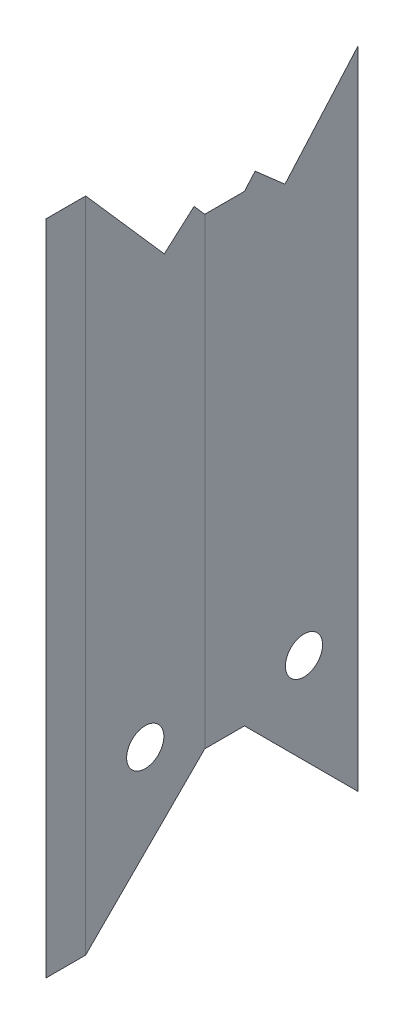
ISO-10303-21;
HEADER;
FILE_DESCRIPTION(('STEP AP214'),'2;1');
FILE_NAME('part.step','',(''),(''),'','','');
FILE_SCHEMA(('AUTOMOTIVE_DESIGN { 1 0 10303 214 1 1 1 1 }'));
ENDSEC;
DATA;
#1=APPLICATION_CONTEXT('core data for automotive mechanical design processes');
#2=APPLICATION_PROTOCOL_DEFINITION('international standard','automotive_design',2000,#1);
#3=PRODUCT_CONTEXT('',#1,'mechanical');
#4=PRODUCT('Part','Part','',(#3));
#5=PRODUCT_RELATED_PRODUCT_CATEGORY('part','',(#4));
#6=PRODUCT_DEFINITION_FORMATION('','',#4);
#7=PRODUCT_DEFINITION_CONTEXT('part definition',#1,'design');
#8=PRODUCT_DEFINITION('design','',#6,#7);
#9=PRODUCT_DEFINITION_SHAPE('','',#8);
#10=(LENGTH_UNIT() NAMED_UNIT(*) SI_UNIT(.MILLI.,.METRE.));
#11=(NAMED_UNIT(*) PLANE_ANGLE_UNIT() SI_UNIT($,.RADIAN.));
#12=(NAMED_UNIT(*) SI_UNIT($,.STERADIAN.) SOLID_ANGLE_UNIT());
#13=UNCERTAINTY_MEASURE_WITH_UNIT(LENGTH_MEASURE(1.E-05),#10,'distance_accuracy_value','');
#14=(GEOMETRIC_REPRESENTATION_CONTEXT(3) GLOBAL_UNCERTAINTY_ASSIGNED_CONTEXT((#13)) GLOBAL_UNIT_ASSIGNED_CONTEXT((#10,
#11,#12)) REPRESENTATION_CONTEXT('',''));
#15=CARTESIAN_POINT('',(0.,0.,0.));
#16=DIRECTION('',(0.,0.,1.));
#17=DIRECTION('',(1.,0.,0.));
#18=AXIS2_PLACEMENT_3D('',#15,#16,#17);
#19=CARTESIAN_POINT('',(210.000000000222,-2.77555756156289E-13,-225.41093404791));
#20=DIRECTION('',(-7.67808940385817E-13,0.,-1.));
#21=DIRECTION('',(-1.,0.,7.67808940385817E-13));
#22=AXIS2_PLACEMENT_3D('',#19,#20,#21);
#23=PLANE('',#22);
#24=DIRECTION('',(1.,0.,0.));
#25=VECTOR('',#24,1.);
#26=CARTESIAN_POINT('',(117.700000000018,334.36429325198,-225.410934047839));
#27=LINE('',#26,#25);
#28=CARTESIAN_POINT('',(117.699000000018,334.36429325198,-225.410934047839));
#29=VERTEX_POINT('',#28);
#30=CARTESIAN_POINT('',(117.699500000018,334.36429325198,-225.410934047839));
#31=VERTEX_POINT('',#30);
#32=EDGE_CURVE('E581',#29,#31,#27,.T.);
#33=ORIENTED_EDGE('',*,*,#32,.T.);
#34=DIRECTION('',(0.,-1.,0.));
#35=VECTOR('',#34,1.);
#36=CARTESIAN_POINT('',(117.699500000018,186.231008312995,-225.410934047839));
#37=LINE('',#36,#35);
#38=CARTESIAN_POINT('',(117.699500000018,38.0980000000001,-225.410934047839));
#39=VERTEX_POINT('',#38);
#40=EDGE_CURVE('E379',#31,#39,#37,.T.);
#41=ORIENTED_EDGE('',*,*,#40,.T.);
#42=DIRECTION('',(1.,0.,-7.67808940385817E-13));
#43=VECTOR('',#42,1.);
#44=CARTESIAN_POINT('',(117.700000000017,38.0980000000001,-225.410934047839));
#45=LINE('',#44,#43);
#46=CARTESIAN_POINT('',(117.699000000018,38.098,-225.410934047839));
#47=VERTEX_POINT('',#46);
#48=EDGE_CURVE('E574',#47,#39,#45,.T.);
#49=ORIENTED_EDGE('',*,*,#48,.F.);
#50=DIRECTION('',(0.,1.,0.));
#51=VECTOR('',#50,1.);
#52=CARTESIAN_POINT('',(117.699000000018,325.368876910929,-225.410934047839));
#53=LINE('',#52,#51);
#54=EDGE_CURVE('E578',#47,#29,#53,.T.);
#55=ORIENTED_EDGE('',*,*,#54,.T.);
#56=EDGE_LOOP('',(#33,#41,#49,#55));
#57=FACE_BOUND('',#56,.T.);
#58=ADVANCED_FACE('F51',(#57),#23,.T.);
#59=CARTESIAN_POINT('',(117.70000000002,382.613735215774,-149.214934047839));
#60=DIRECTION('',(0.,0.,-1.));
#61=DIRECTION('',(0.,-1.,0.));
#62=AXIS2_PLACEMENT_3D('',#59,#60,#61);
#63=PLANE('',#62);
#64=DIRECTION('',(1.,0.,0.));
#65=VECTOR('',#64,1.);
#66=CARTESIAN_POINT('',(117.700000000018,-38.0979999999999,-149.214934047839));
#67=LINE('',#66,#65);
#68=CARTESIAN_POINT('',(117.699000000019,-38.0979999999999,-149.214934047839));
#69=VERTEX_POINT('',#68);
#70=CARTESIAN_POINT('',(117.699500000019,-38.0979999999999,-149.214934047839));
#71=VERTEX_POINT('',#70);
#72=EDGE_CURVE('E566',#69,#71,#67,.T.);
#73=ORIENTED_EDGE('',*,*,#72,.T.);
#74=DIRECTION('',(0.,1.,0.));
#75=VECTOR('',#74,1.);
#76=CARTESIAN_POINT('',(117.69950000002,172.257867607887,-149.214934047839));
#77=LINE('',#76,#75);
#78=CARTESIAN_POINT('',(117.699500000021,382.613735215774,-149.214934047839));
#79=VERTEX_POINT('',#78);
#80=EDGE_CURVE('E417',#71,#79,#77,.T.);
#81=ORIENTED_EDGE('',*,*,#80,.T.);
#82=DIRECTION('',(1.,0.,5.64864391357309E-11));
#83=VECTOR('',#82,1.);
#84=CARTESIAN_POINT('',(117.70000000002,382.613735215774,-149.214934047839));
#85=LINE('',#84,#83);
#86=CARTESIAN_POINT('',(117.69900000002,382.613735215774,-149.214934047839));
#87=VERTEX_POINT('',#86);
#88=EDGE_CURVE('E559',#87,#79,#85,.T.);
#89=ORIENTED_EDGE('',*,*,#88,.F.);
#90=DIRECTION('',(0.,-1.,0.));
#91=VECTOR('',#90,1.);
#92=CARTESIAN_POINT('',(117.69900000002,325.368876910929,-149.214934047839));
#93=LINE('',#92,#91);
#94=EDGE_CURVE('E563',#87,#69,#93,.T.);
#95=ORIENTED_EDGE('',*,*,#94,.T.);
#96=EDGE_LOOP('',(#73,#81,#89,#95));
#97=FACE_BOUND('',#96,.T.);
#98=ADVANCED_FACE('F859',(#97),#63,.F.);
#99=CARTESIAN_POINT('',(117.700000000018,-19.0499999999999,-168.262934047839));
#100=DIRECTION('',(0.,0.707106781186548,0.707106781186547));
#101=DIRECTION('',(0.,-0.707106781186547,0.707106781186548));
#102=AXIS2_PLACEMENT_3D('',#99,#100,#101);
#103=PLANE('',#102);
#104=ORIENTED_EDGE('',*,*,#72,.F.);
#105=DIRECTION('',(0.,-0.707106781186547,0.707106781186548));
#106=VECTOR('',#105,1.);
#107=CARTESIAN_POINT('',(117.699000000018,-19.0499999999999,-168.262934047839));
#108=LINE('',#107,#106);
#109=EDGE_CURVE('E536',#47,#69,#108,.T.);
#110=ORIENTED_EDGE('',*,*,#109,.F.);
#111=ORIENTED_EDGE('',*,*,#48,.T.);
#112=DIRECTION('',(1.,0.,0.));
#113=VECTOR('',#112,1.);
#114=CARTESIAN_POINT('',(117.700000000018,38.0980000000008,-225.41093404784));
#115=LINE('',#114,#113);
#116=CARTESIAN_POINT('',(117.700000000018,38.0980000000008,-225.41093404784));
#117=VERTEX_POINT('',#116);
#118=EDGE_CURVE('E409',#39,#117,#115,.T.);
#119=ORIENTED_EDGE('',*,*,#118,.T.);
#120=DIRECTION('',(0.,-0.707106781186547,0.707106781186548));
#121=VECTOR('',#120,1.);
#122=CARTESIAN_POINT('',(117.700000000018,-19.0499999999999,-168.262934047839));
#123=LINE('',#122,#121);
#124=CARTESIAN_POINT('',(117.700000000018,-38.0979999999998,-149.214934047839));
#125=VERTEX_POINT('',#124);
#126=EDGE_CURVE('E519',#117,#125,#123,.T.);
#127=ORIENTED_EDGE('',*,*,#126,.T.);
#128=DIRECTION('',(1.,0.,0.));
#129=VECTOR('',#128,1.);
#130=CARTESIAN_POINT('',(117.700000000019,-38.0979999999998,-149.214934047839));
#131=LINE('',#130,#129);
#132=EDGE_CURVE('E501',#71,#125,#131,.T.);
#133=ORIENTED_EDGE('',*,*,#132,.F.);
#134=EDGE_LOOP('',(#104,#110,#111,#119,#127,#133));
#135=FACE_BOUND('',#134,.T.);
#136=ADVANCED_FACE('F633',(#135),#103,.F.);
#137=CARTESIAN_POINT('',(117.700000000019,342.132612713132,-218.586519765696));
#138=DIRECTION('',(0.,0.659989598511923,-0.751274736601778));
#139=DIRECTION('',(0.,0.751274736601778,0.659989598511923));
#140=AXIS2_PLACEMENT_3D('',#137,#138,#139);
#141=PLANE('',#140);
#142=ORIENTED_EDGE('',*,*,#32,.F.);
#143=DIRECTION('',(0.,0.751274736601778,0.659989598511923));
#144=VECTOR('',#143,1.);
#145=CARTESIAN_POINT('',(117.699000000018,342.132612713132,-218.586519765696));
#146=LINE('',#145,#144);
#147=CARTESIAN_POINT('',(117.699000000018,342.132612713132,-218.586519765696));
#148=VERTEX_POINT('',#147);
#149=EDGE_CURVE('E540',#29,#148,#146,.T.);
#150=ORIENTED_EDGE('',*,*,#149,.T.);
#151=DIRECTION('',(1.,0.,0.));
#152=VECTOR('',#151,1.);
#153=CARTESIAN_POINT('',(117.700000000019,342.132612713132,-218.586519765696));
#154=LINE('',#153,#152);
#155=CARTESIAN_POINT('',(117.700000000019,342.132612713132,-218.586519765696));
#156=VERTEX_POINT('',#155);
#157=EDGE_CURVE('E552',#148,#156,#154,.T.);
#158=ORIENTED_EDGE('',*,*,#157,.T.);
#159=DIRECTION('',(0.,0.751274736601778,0.659989598511923));
#160=VECTOR('',#159,1.);
#161=CARTESIAN_POINT('',(117.700000000019,342.132612713132,-218.586519765696));
#162=LINE('',#161,#160);
#163=CARTESIAN_POINT('',(117.700000000018,334.36429325198,-225.410934047839));
#164=VERTEX_POINT('',#163);
#165=EDGE_CURVE('E523',#164,#156,#162,.T.);
#166=ORIENTED_EDGE('',*,*,#165,.F.);
#167=DIRECTION('',(1.,0.,0.));
#168=VECTOR('',#167,1.);
#169=CARTESIAN_POINT('',(117.700000000018,334.36429325198,-225.410934047839));
#170=LINE('',#169,#168);
#171=EDGE_CURVE('E393',#31,#164,#170,.T.);
#172=ORIENTED_EDGE('',*,*,#171,.F.);
#173=EDGE_LOOP('',(#142,#150,#158,#166,#172));
#174=FACE_BOUND('',#173,.T.);
#175=ADVANCED_FACE('F644',(#174),#141,.T.);
#176=CARTESIAN_POINT('',(117.700000000019,325.368876910929,-199.504141456011));
#177=DIRECTION('',(0.,-0.751274736601778,-0.659989598511923));
#178=DIRECTION('',(0.,0.659989598511923,-0.751274736601778));
#179=AXIS2_PLACEMENT_3D('',#176,#177,#178);
#180=PLANE('',#179);
#181=ORIENTED_EDGE('',*,*,#157,.F.);
#182=DIRECTION('',(0.,0.659989598511923,-0.751274736601778));
#183=VECTOR('',#182,1.);
#184=CARTESIAN_POINT('',(117.699000000019,325.368876910929,-199.504141456011));
#185=LINE('',#184,#183);
#186=CARTESIAN_POINT('',(117.699000000019,325.368876910929,-199.504141456011));
#187=VERTEX_POINT('',#186);
#188=EDGE_CURVE('E505',#187,#148,#185,.T.);
#189=ORIENTED_EDGE('',*,*,#188,.F.);
#190=DIRECTION('',(1.,0.,0.));
#191=VECTOR('',#190,1.);
#192=CARTESIAN_POINT('',(117.700000000019,325.368876910929,-199.504141456011));
#193=LINE('',#192,#191);
#194=CARTESIAN_POINT('',(117.700000000019,325.368876910929,-199.504141456011));
#195=VERTEX_POINT('',#194);
#196=EDGE_CURVE('E531',#187,#195,#193,.T.);
#197=ORIENTED_EDGE('',*,*,#196,.T.);
#198=DIRECTION('',(0.,0.659989598511923,-0.751274736601778));
#199=VECTOR('',#198,1.);
#200=CARTESIAN_POINT('',(117.700000000019,325.368876910929,-199.504141456011));
#201=LINE('',#200,#199);
#202=EDGE_CURVE('E510',#195,#156,#201,.T.);
#203=ORIENTED_EDGE('',*,*,#202,.T.);
#204=EDGE_LOOP('',(#181,#189,#197,#203));
#205=FACE_BOUND('',#204,.T.);
#206=ADVANCED_FACE('F877',(#205),#180,.F.);
#207=CARTESIAN_POINT('',(117.700000000015,166.6622814955,-338.926774863348));
#208=DIRECTION('',(0.,0.659989598511923,-0.751274736601778));
#209=DIRECTION('',(0.,0.751274736601778,0.659989598511923));
#210=AXIS2_PLACEMENT_3D('',#207,#208,#209);
#211=PLANE('',#210);
#212=ORIENTED_EDGE('',*,*,#196,.F.);
#213=DIRECTION('',(0.,0.751274736601778,0.659989598511923));
#214=VECTOR('',#213,1.);
#215=CARTESIAN_POINT('',(117.699000000015,166.6622814955,-338.926774863348));
#216=LINE('',#215,#214);
#217=EDGE_CURVE('E532',#187,#87,#216,.T.);
#218=ORIENTED_EDGE('',*,*,#217,.T.);
#219=ORIENTED_EDGE('',*,*,#88,.T.);
#220=DIRECTION('',(1.,0.,0.));
#221=VECTOR('',#220,1.);
#222=CARTESIAN_POINT('',(117.70000000002,382.613735215774,-149.214934047839));
#223=LINE('',#222,#221);
#224=CARTESIAN_POINT('',(117.70000000002,382.613735215774,-149.214934047839));
#225=VERTEX_POINT('',#224);
#226=EDGE_CURVE('E496',#79,#225,#223,.T.);
#227=ORIENTED_EDGE('',*,*,#226,.T.);
#228=DIRECTION('',(0.,0.751274736601778,0.659989598511923));
#229=VECTOR('',#228,1.);
#230=CARTESIAN_POINT('',(117.700000000015,166.6622814955,-338.926774863348));
#231=LINE('',#230,#229);
#232=EDGE_CURVE('E514',#195,#225,#231,.T.);
#233=ORIENTED_EDGE('',*,*,#232,.F.);
#234=EDGE_LOOP('',(#212,#218,#219,#227,#233));
#235=FACE_BOUND('',#234,.T.);
#236=ADVANCED_FACE('F871',(#235),#211,.T.);
#237=CARTESIAN_POINT('',(117.700000000018,58.1000000000001,-187.312934047839));
#238=DIRECTION('',(1.,0.,0.));
#239=DIRECTION('',(0.,0.,-1.));
#240=AXIS2_PLACEMENT_3D('',#237,#238,#239);
#241=CYLINDRICAL_SURFACE('',#240,11.90625);
#242=CARTESIAN_POINT('',(117.700000000018,58.1000000000001,-187.312934047839));
#243=DIRECTION('',(-1.,0.,0.));
#244=DIRECTION('',(0.,0.,1.));
#245=AXIS2_PLACEMENT_3D('',#242,#243,#244);
#246=CIRCLE('',#245,11.90625);
#247=CARTESIAN_POINT('',(117.700000000018,58.1000000000001,-175.406684047839));
#248=VERTEX_POINT('',#247);
#249=EDGE_CURVE('E527',#248,#248,#246,.T.);
#250=ORIENTED_EDGE('',*,*,#249,.F.);
#251=EDGE_LOOP('',(#250));
#252=FACE_BOUND('',#251,.T.);
#253=CARTESIAN_POINT('',(117.699000000018,58.1000000000001,-187.312934047839));
#254=DIRECTION('',(-1.,0.,0.));
#255=DIRECTION('',(0.,0.,1.));
#256=AXIS2_PLACEMENT_3D('',#253,#254,#255);
#257=CIRCLE('',#256,11.90625);
#258=CARTESIAN_POINT('',(117.699000000018,58.1000000000001,-175.406684047839));
#259=VERTEX_POINT('',#258);
#260=EDGE_CURVE('E515',#259,#259,#257,.T.);
#261=ORIENTED_EDGE('',*,*,#260,.T.);
#262=EDGE_LOOP('',(#261));
#263=FACE_BOUND('',#262,.T.);
#264=ADVANCED_FACE('F867',(#252,#263),#241,.F.);
#265=CARTESIAN_POINT('',(117.700000000019,325.368876910929,-199.504141456011));
#266=DIRECTION('',(1.,0.,0.));
#267=DIRECTION('',(0.,0.,-1.));
#268=AXIS2_PLACEMENT_3D('',#265,#266,#267);
#269=PLANE('',#268);
#270=ORIENTED_EDGE('',*,*,#126,.F.);
#271=DIRECTION('',(0.,1.,0.));
#272=VECTOR('',#271,1.);
#273=CARTESIAN_POINT('',(117.700000000018,325.368876910929,-225.410934047839));
#274=LINE('',#273,#272);
#275=EDGE_CURVE('E570',#117,#164,#274,.T.);
#276=ORIENTED_EDGE('',*,*,#275,.T.);
#277=ORIENTED_EDGE('',*,*,#165,.T.);
#278=ORIENTED_EDGE('',*,*,#202,.F.);
#279=ORIENTED_EDGE('',*,*,#232,.T.);
#280=DIRECTION('',(0.,-1.,0.));
#281=VECTOR('',#280,1.);
#282=CARTESIAN_POINT('',(117.700000000019,-38.0999999999999,-149.214934047839));
#283=LINE('',#282,#281);
#284=EDGE_CURVE('E555',#225,#125,#283,.T.);
#285=ORIENTED_EDGE('',*,*,#284,.T.);
#286=EDGE_LOOP('',(#270,#276,#277,#278,#279,#285));
#287=FACE_BOUND('',#286,.T.);
#288=ORIENTED_EDGE('',*,*,#249,.T.);
#289=EDGE_LOOP('',(#288));
#290=FACE_BOUND('',#289,.T.);
#291=ADVANCED_FACE('F870',(#287,#290),#269,.T.);
#292=CARTESIAN_POINT('',(117.699000000019,325.368876910929,-199.504141456011));
#293=DIRECTION('',(1.,0.,0.));
#294=DIRECTION('',(0.,0.,-1.));
#295=AXIS2_PLACEMENT_3D('',#292,#293,#294);
#296=PLANE('',#295);
#297=ORIENTED_EDGE('',*,*,#109,.T.);
#298=ORIENTED_EDGE('',*,*,#94,.F.);
#299=ORIENTED_EDGE('',*,*,#217,.F.);
#300=ORIENTED_EDGE('',*,*,#188,.T.);
#301=ORIENTED_EDGE('',*,*,#149,.F.);
#302=ORIENTED_EDGE('',*,*,#54,.F.);
#303=EDGE_LOOP('',(#297,#298,#299,#300,#301,#302));
#304=FACE_BOUND('',#303,.T.);
#305=ORIENTED_EDGE('',*,*,#260,.F.);
#306=EDGE_LOOP('',(#305));
#307=FACE_BOUND('',#306,.T.);
#308=ADVANCED_FACE('F639',(#304,#307),#296,.F.);
#309=CARTESIAN_POINT('',(117.70000000002,172.257867607887,-149.214934047839));
#310=DIRECTION('',(0.,0.,-1.));
#311=DIRECTION('',(0.,1.,0.));
#312=AXIS2_PLACEMENT_3D('',#309,#310,#311);
#313=PLANE('',#312);
#314=ORIENTED_EDGE('',*,*,#284,.F.);
#315=CARTESIAN_POINT('',(117.70050000002,382.613735215774,-149.214934047839));
#316=VERTEX_POINT('',#315);
#317=EDGE_CURVE('E494',#225,#316,#223,.T.);
#318=ORIENTED_EDGE('',*,*,#317,.T.);
#319=DIRECTION('',(0.,1.,0.));
#320=VECTOR('',#319,1.);
#321=CARTESIAN_POINT('',(117.70050000002,172.257867607887,-149.214934047839));
#322=LINE('',#321,#320);
#323=CARTESIAN_POINT('',(117.700500000019,-38.0979999999999,-149.214934047839));
#324=VERTEX_POINT('',#323);
#325=EDGE_CURVE('E467',#324,#316,#322,.T.);
#326=ORIENTED_EDGE('',*,*,#325,.F.);
#327=EDGE_CURVE('E500',#125,#324,#131,.T.);
#328=ORIENTED_EDGE('',*,*,#327,.F.);
#329=EDGE_LOOP('',(#314,#318,#326,#328));
#330=FACE_BOUND('',#329,.T.);
#331=ADVANCED_FACE('F886',(#330),#313,.T.);
#332=CARTESIAN_POINT('',(117.70000000002,382.613735215774,-149.214934047839));
#333=DIRECTION('',(0.,0.719145252296358,-0.694859774414671));
#334=DIRECTION('',(0.,0.694859774414671,0.719145252296358));
#335=AXIS2_PLACEMENT_3D('',#332,#333,#334);
#336=PLANE('',#335);
#337=ORIENTED_EDGE('',*,*,#226,.F.);
#338=DIRECTION('',(0.,0.694859774414671,0.719145252296358));
#339=VECTOR('',#338,1.);
#340=CARTESIAN_POINT('',(117.69950000002,382.613735215774,-149.214934047839));
#341=LINE('',#340,#339);
#342=CARTESIAN_POINT('',(117.69950000002,382.616011841764,-149.212577853349));
#343=VERTEX_POINT('',#342);
#344=EDGE_CURVE('E480',#79,#343,#341,.T.);
#345=ORIENTED_EDGE('',*,*,#344,.T.);
#346=DIRECTION('',(1.,0.,0.));
#347=VECTOR('',#346,1.);
#348=CARTESIAN_POINT('',(117.70000000002,382.616011841764,-149.212577853349));
#349=LINE('',#348,#347);
#350=CARTESIAN_POINT('',(117.700000000021,382.616011841764,-149.212577853349));
#351=VERTEX_POINT('',#350);
#352=EDGE_CURVE('E490',#343,#351,#349,.T.);
#353=ORIENTED_EDGE('',*,*,#352,.T.);
#354=CARTESIAN_POINT('',(117.70050000002,382.616011841764,-149.212577853349));
#355=VERTEX_POINT('',#354);
#356=EDGE_CURVE('E495',#351,#355,#349,.T.);
#357=ORIENTED_EDGE('',*,*,#356,.T.);
#358=DIRECTION('',(0.,0.694859774414671,0.719145252296358));
#359=VECTOR('',#358,1.);
#360=CARTESIAN_POINT('',(117.70050000002,382.613735215774,-149.214934047839));
#361=LINE('',#360,#359);
#362=EDGE_CURVE('E463',#316,#355,#361,.T.);
#363=ORIENTED_EDGE('',*,*,#362,.F.);
#364=ORIENTED_EDGE('',*,*,#317,.F.);
#365=EDGE_LOOP('',(#337,#345,#353,#357,#363,#364));
#366=FACE_BOUND('',#365,.T.);
#367=ADVANCED_FACE('F898',(#366),#336,.T.);
#368=CARTESIAN_POINT('',(117.70000000002,172.257867607887,-149.212577853349));
#369=DIRECTION('',(0.,0.,-1.));
#370=DIRECTION('',(0.,1.,0.));
#371=AXIS2_PLACEMENT_3D('',#368,#369,#370);
#372=PLANE('',#371);
#373=DIRECTION('',(0.,1.,0.));
#374=VECTOR('',#373,1.);
#375=CARTESIAN_POINT('',(117.70000000002,382.616011841764,-149.212577853349));
#376=LINE('',#375,#374);
#377=CARTESIAN_POINT('',(117.700000000019,-38.0999999999999,-149.212577853349));
#378=VERTEX_POINT('',#377);
#379=EDGE_CURVE('E441',#378,#351,#376,.T.);
#380=ORIENTED_EDGE('',*,*,#379,.F.);
#381=DIRECTION('',(1.,0.,0.));
#382=VECTOR('',#381,1.);
#383=CARTESIAN_POINT('',(117.700000000019,-38.0999999999999,-149.212577853349));
#384=LINE('',#383,#382);
#385=CARTESIAN_POINT('',(117.700500000019,-38.0999999999998,-149.212577853349));
#386=VERTEX_POINT('',#385);
#387=EDGE_CURVE('E475',#378,#386,#384,.T.);
#388=ORIENTED_EDGE('',*,*,#387,.T.);
#389=DIRECTION('',(0.,1.,0.));
#390=VECTOR('',#389,1.);
#391=CARTESIAN_POINT('',(117.70050000002,172.257867607887,-149.212577853349));
#392=LINE('',#391,#390);
#393=EDGE_CURVE('E458',#355,#386,#392,.F.);
#394=ORIENTED_EDGE('',*,*,#393,.F.);
#395=ORIENTED_EDGE('',*,*,#356,.F.);
#396=EDGE_LOOP('',(#380,#388,#394,#395));
#397=FACE_BOUND('',#396,.T.);
#398=ADVANCED_FACE('F894',(#397),#372,.F.);
#399=CARTESIAN_POINT('',(117.700000000019,-38.0999999999999,-149.212577853349));
#400=DIRECTION('',(0.,-0.762380675876459,-0.647128816426956));
#401=DIRECTION('',(0.,0.647128816426956,-0.762380675876459));
#402=AXIS2_PLACEMENT_3D('',#399,#400,#401);
#403=PLANE('',#402);
#404=DIRECTION('',(0.,0.647128816426956,-0.762380675876459));
#405=VECTOR('',#404,1.);
#406=CARTESIAN_POINT('',(117.699500000019,-38.0999999999999,-149.212577853349));
#407=LINE('',#406,#405);
#408=CARTESIAN_POINT('',(117.699500000019,-38.0999999999999,-149.212577853349));
#409=VERTEX_POINT('',#408);
#410=EDGE_CURVE('E471',#409,#71,#407,.T.);
#411=ORIENTED_EDGE('',*,*,#410,.T.);
#412=ORIENTED_EDGE('',*,*,#132,.T.);
#413=ORIENTED_EDGE('',*,*,#327,.T.);
#414=DIRECTION('',(0.,0.647128816426956,-0.762380675876459));
#415=VECTOR('',#414,1.);
#416=CARTESIAN_POINT('',(117.700500000019,-38.0999999999999,-149.212577853349));
#417=LINE('',#416,#415);
#418=EDGE_CURVE('E462',#386,#324,#417,.T.);
#419=ORIENTED_EDGE('',*,*,#418,.F.);
#420=ORIENTED_EDGE('',*,*,#387,.F.);
#421=EDGE_CURVE('E506',#409,#378,#384,.T.);
#422=ORIENTED_EDGE('',*,*,#421,.F.);
#423=EDGE_LOOP('',(#411,#412,#413,#419,#420,#422));
#424=FACE_BOUND('',#423,.T.);
#425=ADVANCED_FACE('F890',(#424),#403,.T.);
#426=CARTESIAN_POINT('',(117.70050000002,172.257867607887,-149.213755950594));
#427=DIRECTION('',(1.,0.,0.));
#428=DIRECTION('',(0.,0.,-1.));
#429=AXIS2_PLACEMENT_3D('',#426,#427,#428);
#430=PLANE('',#429);
#431=ORIENTED_EDGE('',*,*,#393,.T.);
#432=ORIENTED_EDGE('',*,*,#418,.T.);
#433=ORIENTED_EDGE('',*,*,#325,.T.);
#434=ORIENTED_EDGE('',*,*,#362,.T.);
#435=EDGE_LOOP('',(#431,#432,#433,#434));
#436=FACE_BOUND('',#435,.T.);
#437=ADVANCED_FACE('F893',(#436),#430,.T.);
#438=CARTESIAN_POINT('',(117.69950000002,172.257867607887,-149.213755950594));
#439=DIRECTION('',(1.,0.,0.));
#440=DIRECTION('',(0.,0.,-1.));
#441=AXIS2_PLACEMENT_3D('',#438,#439,#440);
#442=PLANE('',#441);
#443=DIRECTION('',(0.,1.,0.));
#444=VECTOR('',#443,1.);
#445=CARTESIAN_POINT('',(117.69950000002,172.257867607887,-149.212577853349));
#446=LINE('',#445,#444);
#447=EDGE_CURVE('E476',#343,#409,#446,.F.);
#448=ORIENTED_EDGE('',*,*,#447,.F.);
#449=ORIENTED_EDGE('',*,*,#344,.F.);
#450=ORIENTED_EDGE('',*,*,#80,.F.);
#451=ORIENTED_EDGE('',*,*,#410,.F.);
#452=EDGE_LOOP('',(#448,#449,#450,#451));
#453=FACE_BOUND('',#452,.T.);
#454=ADVANCED_FACE('F906',(#453),#442,.F.);
#455=CARTESIAN_POINT('',(-209.309646436649,6.10622663543836E-13,-149.212577852806));
#456=DIRECTION('',(-1.65844483926508E-12,0.,-1.));
#457=DIRECTION('',(-1.,0.,1.65844483926508E-12));
#458=AXIS2_PLACEMENT_3D('',#455,#456,#457);
#459=PLANE('',#458);
#460=DIRECTION('',(1.,0.,0.));
#461=VECTOR('',#460,1.);
#462=CARTESIAN_POINT('',(117.70000000002,382.616011841764,-149.212577853349));
#463=LINE('',#462,#461);
#464=CARTESIAN_POINT('',(117.69900000002,382.616011841764,-149.212577853349));
#465=VERTEX_POINT('',#464);
#466=EDGE_CURVE('E452',#465,#343,#463,.T.);
#467=ORIENTED_EDGE('',*,*,#466,.T.);
#468=ORIENTED_EDGE('',*,*,#447,.T.);
#469=DIRECTION('',(1.,0.,-1.65844483926508E-12));
#470=VECTOR('',#469,1.);
#471=CARTESIAN_POINT('',(117.700000000019,-38.0999999999999,-149.212577853349));
#472=LINE('',#471,#470);
#473=CARTESIAN_POINT('',(117.699000000019,-38.0999999999999,-149.212577853349));
#474=VERTEX_POINT('',#473);
#475=EDGE_CURVE('E418',#474,#409,#472,.T.);
#476=ORIENTED_EDGE('',*,*,#475,.F.);
#477=DIRECTION('',(0.,1.,0.));
#478=VECTOR('',#477,1.);
#479=CARTESIAN_POINT('',(117.699000000019,1.66533453693773E-13,-149.212577853349));
#480=LINE('',#479,#478);
#481=EDGE_CURVE('E408',#474,#465,#480,.T.);
#482=ORIENTED_EDGE('',*,*,#481,.T.);
#483=EDGE_LOOP('',(#467,#468,#476,#482));
#484=FACE_BOUND('',#483,.T.);
#485=ADVANCED_FACE('F909',(#484),#459,.T.);
#486=CARTESIAN_POINT('',(117.70000000002,2.77555756156289E-13,-123.814577853348));
#487=DIRECTION('',(0.,0.,1.));
#488=DIRECTION('',(0.,1.,0.));
#489=AXIS2_PLACEMENT_3D('',#486,#487,#488);
#490=PLANE('',#489);
#491=DIRECTION('',(1.,0.,0.));
#492=VECTOR('',#491,1.);
#493=CARTESIAN_POINT('',(117.700000000021,382.616011841764,-123.814577853348));
#494=LINE('',#493,#492);
#495=CARTESIAN_POINT('',(117.699000000021,382.616011841765,-123.814577853348));
#496=VERTEX_POINT('',#495);
#497=CARTESIAN_POINT('',(117.700000000021,382.616011841764,-123.814577853348));
#498=VERTEX_POINT('',#497);
#499=EDGE_CURVE('E430',#496,#498,#494,.T.);
#500=ORIENTED_EDGE('',*,*,#499,.F.);
#501=DIRECTION('',(0.,1.,0.));
#502=VECTOR('',#501,1.);
#503=CARTESIAN_POINT('',(117.69900000002,2.22044604925031E-13,-123.814577853348));
#504=LINE('',#503,#502);
#505=CARTESIAN_POINT('',(117.69900000002,-38.0999999999998,-123.814577853348));
#506=VERTEX_POINT('',#505);
#507=EDGE_CURVE('E422',#506,#496,#504,.T.);
#508=ORIENTED_EDGE('',*,*,#507,.F.);
#509=DIRECTION('',(1.,0.,0.));
#510=VECTOR('',#509,1.);
#511=CARTESIAN_POINT('',(117.70000000002,-38.0999999999998,-123.814577853348));
#512=LINE('',#511,#510);
#513=CARTESIAN_POINT('',(117.70000000002,-38.0999999999998,-123.814577853348));
#514=VERTEX_POINT('',#513);
#515=EDGE_CURVE('E449',#506,#514,#512,.T.);
#516=ORIENTED_EDGE('',*,*,#515,.T.);
#517=DIRECTION('',(0.,1.,0.));
#518=VECTOR('',#517,1.);
#519=CARTESIAN_POINT('',(117.70000000002,2.77555756156289E-13,-123.814577853348));
#520=LINE('',#519,#518);
#521=EDGE_CURVE('E445',#514,#498,#520,.T.);
#522=ORIENTED_EDGE('',*,*,#521,.T.);
#523=EDGE_LOOP('',(#500,#508,#516,#522));
#524=FACE_BOUND('',#523,.T.);
#525=ADVANCED_FACE('F916',(#524),#490,.T.);
#526=CARTESIAN_POINT('',(117.700000000019,1.66533453693773E-13,-149.214577853348));
#527=DIRECTION('',(-1.,0.,0.));
#528=DIRECTION('',(0.,0.,1.));
#529=AXIS2_PLACEMENT_3D('',#526,#527,#528);
#530=PLANE('',#529);
#531=DIRECTION('',(0.,0.,1.));
#532=VECTOR('',#531,1.);
#533=CARTESIAN_POINT('',(117.700000000019,-38.0999999999999,-149.214577853348));
#534=LINE('',#533,#532);
#535=EDGE_CURVE('E413',#378,#514,#534,.T.);
#536=ORIENTED_EDGE('',*,*,#535,.F.);
#537=ORIENTED_EDGE('',*,*,#379,.T.);
#538=DIRECTION('',(0.,0.,1.));
#539=VECTOR('',#538,1.);
#540=CARTESIAN_POINT('',(117.70000000002,382.616011841764,-149.214577853349));
#541=LINE('',#540,#539);
#542=EDGE_CURVE('E437',#351,#498,#541,.T.);
#543=ORIENTED_EDGE('',*,*,#542,.T.);
#544=ORIENTED_EDGE('',*,*,#521,.F.);
#545=EDGE_LOOP('',(#536,#537,#543,#544));
#546=FACE_BOUND('',#545,.T.);
#547=ADVANCED_FACE('F928',(#546),#530,.F.);
#548=CARTESIAN_POINT('',(117.70000000002,382.616011841764,-149.214577853349));
#549=DIRECTION('',(0.,-1.,0.));
#550=DIRECTION('',(0.,0.,1.));
#551=AXIS2_PLACEMENT_3D('',#548,#549,#550);
#552=PLANE('',#551);
#553=ORIENTED_EDGE('',*,*,#466,.F.);
#554=DIRECTION('',(0.,0.,1.));
#555=VECTOR('',#554,1.);
#556=CARTESIAN_POINT('',(117.69900000002,382.616011841765,-149.214577853349));
#557=LINE('',#556,#555);
#558=EDGE_CURVE('E433',#465,#496,#557,.T.);
#559=ORIENTED_EDGE('',*,*,#558,.T.);
#560=ORIENTED_EDGE('',*,*,#499,.T.);
#561=ORIENTED_EDGE('',*,*,#542,.F.);
#562=ORIENTED_EDGE('',*,*,#352,.F.);
#563=EDGE_LOOP('',(#553,#559,#560,#561,#562));
#564=FACE_BOUND('',#563,.T.);
#565=ADVANCED_FACE('F924',(#564),#552,.F.);
#566=CARTESIAN_POINT('',(117.699000000019,1.66533453693773E-13,-149.214577853348));
#567=DIRECTION('',(-1.,0.,0.));
#568=DIRECTION('',(0.,0.,1.));
#569=AXIS2_PLACEMENT_3D('',#566,#567,#568);
#570=PLANE('',#569);
#571=DIRECTION('',(0.,0.,1.));
#572=VECTOR('',#571,1.);
#573=CARTESIAN_POINT('',(117.699000000019,-38.0999999999999,-149.214577853348));
#574=LINE('',#573,#572);
#575=EDGE_CURVE('E426',#474,#506,#574,.T.);
#576=ORIENTED_EDGE('',*,*,#575,.T.);
#577=ORIENTED_EDGE('',*,*,#507,.T.);
#578=ORIENTED_EDGE('',*,*,#558,.F.);
#579=ORIENTED_EDGE('',*,*,#481,.F.);
#580=EDGE_LOOP('',(#576,#577,#578,#579));
#581=FACE_BOUND('',#580,.T.);
#582=ADVANCED_FACE('F920',(#581),#570,.T.);
#583=CARTESIAN_POINT('',(117.700000000019,-38.0999999999999,-149.214577853348));
#584=DIRECTION('',(0.,-1.,0.));
#585=DIRECTION('',(0.,0.,1.));
#586=AXIS2_PLACEMENT_3D('',#583,#584,#585);
#587=PLANE('',#586);
#588=ORIENTED_EDGE('',*,*,#515,.F.);
#589=ORIENTED_EDGE('',*,*,#575,.F.);
#590=ORIENTED_EDGE('',*,*,#475,.T.);
#591=ORIENTED_EDGE('',*,*,#421,.T.);
#592=ORIENTED_EDGE('',*,*,#535,.T.);
#593=EDGE_LOOP('',(#588,#589,#590,#591,#592));
#594=FACE_BOUND('',#593,.T.);
#595=ADVANCED_FACE('F855',(#594),#587,.T.);
#596=CARTESIAN_POINT('',(117.700000000018,186.231008312995,-225.410934047839));
#597=DIRECTION('',(0.,0.,1.));
#598=DIRECTION('',(0.,-1.,0.));
#599=AXIS2_PLACEMENT_3D('',#596,#597,#598);
#600=PLANE('',#599);
#601=ORIENTED_EDGE('',*,*,#275,.F.);
#602=CARTESIAN_POINT('',(117.700500000018,38.0980000000007,-225.41093404784));
#603=VERTEX_POINT('',#602);
#604=EDGE_CURVE('E378',#117,#603,#115,.T.);
#605=ORIENTED_EDGE('',*,*,#604,.T.);
#606=DIRECTION('',(0.,-1.,0.));
#607=VECTOR('',#606,1.);
#608=CARTESIAN_POINT('',(117.700500000018,186.231008312995,-225.410934047839));
#609=LINE('',#608,#607);
#610=CARTESIAN_POINT('',(117.700500000018,334.36429325198,-225.410934047839));
#611=VERTEX_POINT('',#610);
#612=EDGE_CURVE('E361',#611,#603,#609,.T.);
#613=ORIENTED_EDGE('',*,*,#612,.F.);
#614=EDGE_CURVE('E398',#164,#611,#170,.T.);
#615=ORIENTED_EDGE('',*,*,#614,.F.);
#616=EDGE_LOOP('',(#601,#605,#613,#615));
#617=FACE_BOUND('',#616,.T.);
#618=ADVANCED_FACE('F652',(#617),#600,.T.);
#619=CARTESIAN_POINT('',(117.700000000018,186.231008312995,-225.413290242329));
#620=DIRECTION('',(0.,0.,1.));
#621=DIRECTION('',(0.,-1.,0.));
#622=AXIS2_PLACEMENT_3D('',#619,#620,#621);
#623=PLANE('',#622);
#624=DIRECTION('',(0.,-1.,0.));
#625=VECTOR('',#624,1.);
#626=CARTESIAN_POINT('',(117.700000000018,295.876561616896,-225.413290242329));
#627=LINE('',#626,#625);
#628=CARTESIAN_POINT('',(117.700000000018,334.36201662599,-225.413290242328));
#629=VERTEX_POINT('',#628);
#630=CARTESIAN_POINT('',(117.700000000018,38.1000000000001,-225.413290242329));
#631=VERTEX_POINT('',#630);
#632=EDGE_CURVE('E348',#629,#631,#627,.T.);
#633=ORIENTED_EDGE('',*,*,#632,.F.);
#634=DIRECTION('',(1.,0.,0.));
#635=VECTOR('',#634,1.);
#636=CARTESIAN_POINT('',(117.700000000018,334.36201662599,-225.413290242328));
#637=LINE('',#636,#635);
#638=CARTESIAN_POINT('',(117.700500000018,334.36201662599,-225.413290242328));
#639=VERTEX_POINT('',#638);
#640=EDGE_CURVE('E397',#629,#639,#637,.T.);
#641=ORIENTED_EDGE('',*,*,#640,.T.);
#642=DIRECTION('',(0.,-1.,0.));
#643=VECTOR('',#642,1.);
#644=CARTESIAN_POINT('',(117.700500000018,186.231008312995,-225.413290242329));
#645=LINE('',#644,#643);
#646=CARTESIAN_POINT('',(117.700500000018,38.1000000000001,-225.413290242329));
#647=VERTEX_POINT('',#646);
#648=EDGE_CURVE('E370',#647,#639,#645,.F.);
#649=ORIENTED_EDGE('',*,*,#648,.F.);
#650=DIRECTION('',(1.,0.,0.));
#651=VECTOR('',#650,1.);
#652=CARTESIAN_POINT('',(117.700000000018,38.1000000000001,-225.413290242329));
#653=LINE('',#652,#651);
#654=EDGE_CURVE('E403',#631,#647,#653,.T.);
#655=ORIENTED_EDGE('',*,*,#654,.F.);
#656=EDGE_LOOP('',(#633,#641,#649,#655));
#657=FACE_BOUND('',#656,.T.);
#658=ADVANCED_FACE('F847',(#657),#623,.F.);
#659=CARTESIAN_POINT('',(117.700000000018,334.362016625989,-225.413290242329));
#660=DIRECTION('',(0.,0.719145252262494,-0.694859774449719));
#661=DIRECTION('',(0.,0.694859774449719,0.719145252262494));
#662=AXIS2_PLACEMENT_3D('',#659,#660,#661);
#663=PLANE('',#662);
#664=CARTESIAN_POINT('',(117.699500000018,334.362016625989,-225.413290242329));
#665=VERTEX_POINT('',#664);
#666=EDGE_CURVE('E399',#665,#629,#637,.T.);
#667=ORIENTED_EDGE('',*,*,#666,.F.);
#668=DIRECTION('',(0.,0.694859774449719,0.719145252262494));
#669=VECTOR('',#668,1.);
#670=CARTESIAN_POINT('',(117.699500000018,334.362016625989,-225.413290242329));
#671=LINE('',#670,#669);
#672=EDGE_CURVE('E383',#665,#31,#671,.T.);
#673=ORIENTED_EDGE('',*,*,#672,.T.);
#674=ORIENTED_EDGE('',*,*,#171,.T.);
#675=ORIENTED_EDGE('',*,*,#614,.T.);
#676=DIRECTION('',(0.,0.694859774449719,0.719145252262494));
#677=VECTOR('',#676,1.);
#678=CARTESIAN_POINT('',(117.700500000018,334.362016625989,-225.413290242329));
#679=LINE('',#678,#677);
#680=EDGE_CURVE('E366',#639,#611,#679,.T.);
#681=ORIENTED_EDGE('',*,*,#680,.F.);
#682=ORIENTED_EDGE('',*,*,#640,.F.);
#683=EDGE_LOOP('',(#667,#673,#674,#675,#681,#682));
#684=FACE_BOUND('',#683,.T.);
#685=ADVANCED_FACE('F615',(#684),#663,.T.);
#686=CARTESIAN_POINT('',(117.700000000018,38.0980000000002,-225.410934047839));
#687=DIRECTION('',(0.,-0.762380675881687,-0.647128816420797));
#688=DIRECTION('',(0.,0.647128816420797,-0.762380675881687));
#689=AXIS2_PLACEMENT_3D('',#686,#687,#688);
#690=PLANE('',#689);
#691=DIRECTION('',(0.,0.647128816420797,-0.762380675881687));
#692=VECTOR('',#691,1.);
#693=CARTESIAN_POINT('',(117.699500000018,38.0980000000002,-225.410934047839));
#694=LINE('',#693,#692);
#695=CARTESIAN_POINT('',(117.699500000018,38.1000000000001,-225.413290242329));
#696=VERTEX_POINT('',#695);
#697=EDGE_CURVE('E374',#39,#696,#694,.T.);
#698=ORIENTED_EDGE('',*,*,#697,.T.);
#699=EDGE_CURVE('E404',#696,#631,#653,.T.);
#700=ORIENTED_EDGE('',*,*,#699,.T.);
#701=ORIENTED_EDGE('',*,*,#654,.T.);
#702=DIRECTION('',(0.,0.647128816420797,-0.762380675881687));
#703=VECTOR('',#702,1.);
#704=CARTESIAN_POINT('',(117.700500000018,38.0980000000002,-225.410934047839));
#705=LINE('',#704,#703);
#706=EDGE_CURVE('E365',#603,#647,#705,.T.);
#707=ORIENTED_EDGE('',*,*,#706,.F.);
#708=ORIENTED_EDGE('',*,*,#604,.F.);
#709=ORIENTED_EDGE('',*,*,#118,.F.);
#710=EDGE_LOOP('',(#698,#700,#701,#707,#708,#709));
#711=FACE_BOUND('',#710,.T.);
#712=ADVANCED_FACE('F624',(#711),#690,.T.);
#713=CARTESIAN_POINT('',(117.700500000018,186.231008312995,-225.412112145084));
#714=DIRECTION('',(1.,0.,0.));
#715=DIRECTION('',(0.,-1.,0.));
#716=AXIS2_PLACEMENT_3D('',#713,#714,#715);
#717=PLANE('',#716);
#718=ORIENTED_EDGE('',*,*,#612,.T.);
#719=ORIENTED_EDGE('',*,*,#706,.T.);
#720=ORIENTED_EDGE('',*,*,#648,.T.);
#721=ORIENTED_EDGE('',*,*,#680,.T.);
#722=EDGE_LOOP('',(#718,#719,#720,#721));
#723=FACE_BOUND('',#722,.T.);
#724=ADVANCED_FACE('F650',(#723),#717,.T.);
#725=CARTESIAN_POINT('',(117.699500000018,186.231008312995,-225.412112145084));
#726=DIRECTION('',(1.,0.,0.));
#727=DIRECTION('',(0.,-1.,0.));
#728=AXIS2_PLACEMENT_3D('',#725,#726,#727);
#729=PLANE('',#728);
#730=ORIENTED_EDGE('',*,*,#40,.F.);
#731=ORIENTED_EDGE('',*,*,#672,.F.);
#732=DIRECTION('',(0.,-1.,0.));
#733=VECTOR('',#732,1.);
#734=CARTESIAN_POINT('',(117.699500000018,186.231008312995,-225.413290242329));
#735=LINE('',#734,#733);
#736=EDGE_CURVE('E341',#696,#665,#735,.F.);
#737=ORIENTED_EDGE('',*,*,#736,.F.);
#738=ORIENTED_EDGE('',*,*,#697,.F.);
#739=EDGE_LOOP('',(#730,#731,#737,#738));
#740=FACE_BOUND('',#739,.T.);
#741=ADVANCED_FACE('F621',(#740),#729,.F.);
#742=CARTESIAN_POINT('',(368.509646436428,-6.66133814775094E-13,-225.413290243448));
#743=DIRECTION('',(4.45993755187891E-12,0.,1.));
#744=DIRECTION('',(1.,0.,-4.45993755187891E-12));
#745=AXIS2_PLACEMENT_3D('',#742,#743,#744);
#746=PLANE('',#745);
#747=DIRECTION('',(1.,0.,0.));
#748=VECTOR('',#747,1.);
#749=CARTESIAN_POINT('',(117.700000000018,38.1,-225.413290242329));
#750=LINE('',#749,#748);
#751=CARTESIAN_POINT('',(117.699000000018,38.1,-225.413290242329));
#752=VERTEX_POINT('',#751);
#753=EDGE_CURVE('E355',#752,#696,#750,.T.);
#754=ORIENTED_EDGE('',*,*,#753,.T.);
#755=ORIENTED_EDGE('',*,*,#736,.T.);
#756=DIRECTION('',(1.,0.,-4.45993755187891E-12));
#757=VECTOR('',#756,1.);
#758=CARTESIAN_POINT('',(117.700000000018,334.362016625989,-225.413290242329));
#759=LINE('',#758,#757);
#760=CARTESIAN_POINT('',(117.699000000018,334.362016625989,-225.413290242329));
#761=VERTEX_POINT('',#760);
#762=EDGE_CURVE('E337',#761,#665,#759,.T.);
#763=ORIENTED_EDGE('',*,*,#762,.F.);
#764=DIRECTION('',(0.,-1.,0.));
#765=VECTOR('',#764,1.);
#766=CARTESIAN_POINT('',(117.699000000018,295.876561616896,-225.413290242329));
#767=LINE('',#766,#765);
#768=EDGE_CURVE('E287',#761,#752,#767,.T.);
#769=ORIENTED_EDGE('',*,*,#768,.T.);
#770=EDGE_LOOP('',(#754,#755,#763,#769));
#771=FACE_BOUND('',#770,.T.);
#772=ADVANCED_FACE('F619',(#771),#746,.T.);
#773=CARTESIAN_POINT('',(117.700000000018,295.876561616896,-250.80964643682));
#774=DIRECTION('',(1.,0.,0.));
#775=DIRECTION('',(0.,0.,-1.));
#776=AXIS2_PLACEMENT_3D('',#773,#774,#775);
#777=PLANE('',#776);
#778=DIRECTION('',(0.,0.,1.));
#779=VECTOR('',#778,1.);
#780=CARTESIAN_POINT('',(117.700000000018,38.1,-225.41129024233));
#781=LINE('',#780,#779);
#782=CARTESIAN_POINT('',(117.700000000017,38.1000000000001,-250.80929024233));
#783=VERTEX_POINT('',#782);
#784=EDGE_CURVE('E268',#783,#631,#781,.T.);
#785=ORIENTED_EDGE('',*,*,#784,.F.);
#786=DIRECTION('',(0.,-0.647128816449899,-0.762380675856985));
#787=VECTOR('',#786,1.);
#788=CARTESIAN_POINT('',(117.700000000017,38.1,-250.80929024233));
#789=LINE('',#788,#787);
#790=CARTESIAN_POINT('',(117.700000000017,38.098,-250.81164643682));
#791=VERTEX_POINT('',#790);
#792=EDGE_CURVE('E258',#783,#791,#789,.T.);
#793=ORIENTED_EDGE('',*,*,#792,.T.);
#794=DIRECTION('',(0.,0.707106781186547,0.707106781186548));
#795=VECTOR('',#794,1.);
#796=CARTESIAN_POINT('',(117.700000000017,-19.05,-307.95964643682));
#797=LINE('',#796,#795);
#798=CARTESIAN_POINT('',(117.700000000017,-34.552,-323.46164643682));
#799=VERTEX_POINT('',#798);
#800=EDGE_CURVE('E241',#799,#791,#797,.T.);
#801=ORIENTED_EDGE('',*,*,#800,.F.);
#802=DIRECTION('',(0.,-1.,0.));
#803=VECTOR('',#802,1.);
#804=CARTESIAN_POINT('',(117.700000000017,382.616036841764,-323.46164643682));
#805=LINE('',#804,#803);
#806=CARTESIAN_POINT('',(117.700000000017,378.577277335231,-323.46164643682));
#807=VERTEX_POINT('',#806);
#808=EDGE_CURVE('E318',#807,#799,#805,.T.);
#809=ORIENTED_EDGE('',*,*,#808,.F.);
#810=DIRECTION('',(0.,-0.751274736601778,0.659989598511923));
#811=VECTOR('',#810,1.);
#812=CARTESIAN_POINT('',(117.700000000017,166.6622814955,-137.295805621311));
#813=LINE('',#812,#811);
#814=CARTESIAN_POINT('',(117.700000000017,325.368876910929,-276.718439028648));
#815=VERTEX_POINT('',#814);
#816=EDGE_CURVE('E307',#807,#815,#813,.T.);
#817=ORIENTED_EDGE('',*,*,#816,.T.);
#818=DIRECTION('',(0.,-0.659989598511923,-0.751274736601778));
#819=VECTOR('',#818,1.);
#820=CARTESIAN_POINT('',(117.700000000017,342.132612713132,-257.636060718963));
#821=LINE('',#820,#819);
#822=CARTESIAN_POINT('',(117.700000000017,342.132612713132,-257.636060718963));
#823=VERTEX_POINT('',#822);
#824=EDGE_CURVE('E331',#823,#815,#821,.T.);
#825=ORIENTED_EDGE('',*,*,#824,.F.);
#826=DIRECTION('',(0.,-0.751274736601778,0.659989598511923));
#827=VECTOR('',#826,1.);
#828=CARTESIAN_POINT('',(117.700000000018,312.640297419099,-231.727268127135));
#829=LINE('',#828,#827);
#830=CARTESIAN_POINT('',(117.700000000018,334.36429325198,-250.81164643682));
#831=VERTEX_POINT('',#830);
#832=EDGE_CURVE('E311',#823,#831,#829,.T.);
#833=ORIENTED_EDGE('',*,*,#832,.T.);
#834=DIRECTION('',(0.,-0.694859774450016,0.719145252262206));
#835=VECTOR('',#834,1.);
#836=CARTESIAN_POINT('',(117.700000000018,334.36429325198,-250.81164643682));
#837=LINE('',#836,#835);
#838=CARTESIAN_POINT('',(117.700000000018,334.362016625989,-250.80929024233));
#839=VERTEX_POINT('',#838);
#840=EDGE_CURVE('E263',#831,#839,#837,.T.);
#841=ORIENTED_EDGE('',*,*,#840,.T.);
#842=DIRECTION('',(0.,0.,1.));
#843=VECTOR('',#842,1.);
#844=CARTESIAN_POINT('',(117.700000000018,334.362016625989,-225.411290242329));
#845=LINE('',#844,#843);
#846=EDGE_CURVE('E351',#839,#629,#845,.T.);
#847=ORIENTED_EDGE('',*,*,#846,.T.);
#848=ORIENTED_EDGE('',*,*,#632,.T.);
#849=EDGE_LOOP('',(#785,#793,#801,#809,#817,#825,#833,#841,#847,#848));
#850=FACE_BOUND('',#849,.T.);
#851=CARTESIAN_POINT('',(117.700000000017,58.1,-288.90964643682));
#852=DIRECTION('',(1.,0.,0.));
#853=DIRECTION('',(0.,0.,-1.));
#854=AXIS2_PLACEMENT_3D('',#851,#852,#853);
#855=CIRCLE('',#854,11.90625);
#856=CARTESIAN_POINT('',(117.700000000017,58.1,-300.81589643682));
#857=VERTEX_POINT('',#856);
#858=EDGE_CURVE('E314',#857,#857,#855,.T.);
#859=ORIENTED_EDGE('',*,*,#858,.F.);
#860=EDGE_LOOP('',(#859));
#861=FACE_BOUND('',#860,.T.);
#862=ADVANCED_FACE('F53',(#850,#861),#777,.T.);
#863=CARTESIAN_POINT('',(117.700000000018,38.1,-225.41129024233));
#864=DIRECTION('',(0.,1.,0.));
#865=DIRECTION('',(0.,0.,1.));
#866=AXIS2_PLACEMENT_3D('',#863,#864,#865);
#867=PLANE('',#866);
#868=ORIENTED_EDGE('',*,*,#753,.F.);
#869=DIRECTION('',(0.,0.,-1.));
#870=VECTOR('',#869,1.);
#871=CARTESIAN_POINT('',(117.699000000018,38.0999999999999,-225.41129024233));
#872=LINE('',#871,#870);
#873=CARTESIAN_POINT('',(117.699000000017,38.0999999999999,-250.80929024233));
#874=VERTEX_POINT('',#873);
#875=EDGE_CURVE('E75',#874,#752,#872,.F.);
#876=ORIENTED_EDGE('',*,*,#875,.F.);
#877=DIRECTION('',(1.,0.,0.));
#878=VECTOR('',#877,1.);
#879=CARTESIAN_POINT('',(117.700000000017,38.1000000000001,-250.80929024233));
#880=LINE('',#879,#878);
#881=EDGE_CURVE('E60',#874,#783,#880,.T.);
#882=ORIENTED_EDGE('',*,*,#881,.T.);
#883=ORIENTED_EDGE('',*,*,#784,.T.);
#884=ORIENTED_EDGE('',*,*,#699,.F.);
#885=EDGE_LOOP('',(#868,#876,#882,#883,#884));
#886=FACE_BOUND('',#885,.T.);
#887=ADVANCED_FACE('F587',(#886),#867,.F.);
#888=CARTESIAN_POINT('',(117.699000000018,295.876561616896,-225.411290242329));
#889=DIRECTION('',(1.,0.,0.));
#890=DIRECTION('',(0.,0.,-1.));
#891=AXIS2_PLACEMENT_3D('',#888,#889,#890);
#892=PLANE('',#891);
#893=ORIENTED_EDGE('',*,*,#875,.T.);
#894=ORIENTED_EDGE('',*,*,#768,.F.);
#895=DIRECTION('',(0.,0.,-1.));
#896=VECTOR('',#895,1.);
#897=CARTESIAN_POINT('',(117.699000000018,334.362016625989,-225.411290242329));
#898=LINE('',#897,#896);
#899=CARTESIAN_POINT('',(117.699000000018,334.362016625989,-250.80929024233));
#900=VERTEX_POINT('',#899);
#901=EDGE_CURVE('E67',#900,#761,#898,.F.);
#902=ORIENTED_EDGE('',*,*,#901,.F.);
#903=DIRECTION('',(0.,-0.694859774450016,0.719145252262206));
#904=VECTOR('',#903,1.);
#905=CARTESIAN_POINT('',(117.699000000018,334.36429325198,-250.81164643682));
#906=LINE('',#905,#904);
#907=CARTESIAN_POINT('',(117.699000000018,334.36429325198,-250.81164643682));
#908=VERTEX_POINT('',#907);
#909=EDGE_CURVE('E270',#908,#900,#906,.T.);
#910=ORIENTED_EDGE('',*,*,#909,.F.);
#911=DIRECTION('',(0.,-0.751274736601778,0.659989598511923));
#912=VECTOR('',#911,1.);
#913=CARTESIAN_POINT('',(117.699000000018,312.640297419099,-231.727268127135));
#914=LINE('',#913,#912);
#915=CARTESIAN_POINT('',(117.699000000018,342.132612713132,-257.636060718963));
#916=VERTEX_POINT('',#915);
#917=EDGE_CURVE('E288',#916,#908,#914,.T.);
#918=ORIENTED_EDGE('',*,*,#917,.F.);
#919=DIRECTION('',(0.,-0.659989598511923,-0.751274736601778));
#920=VECTOR('',#919,1.);
#921=CARTESIAN_POINT('',(117.699000000017,342.132612713132,-257.636060718963));
#922=LINE('',#921,#920);
#923=CARTESIAN_POINT('',(117.699000000017,325.368876910929,-276.718439028648));
#924=VERTEX_POINT('',#923);
#925=EDGE_CURVE('E298',#916,#924,#922,.T.);
#926=ORIENTED_EDGE('',*,*,#925,.T.);
#927=DIRECTION('',(0.,-0.751274736601778,0.659989598511923));
#928=VECTOR('',#927,1.);
#929=CARTESIAN_POINT('',(117.699000000017,166.6622814955,-137.295805621311));
#930=LINE('',#929,#928);
#931=CARTESIAN_POINT('',(117.699000000016,378.577277335231,-323.46164643682));
#932=VERTEX_POINT('',#931);
#933=EDGE_CURVE('E327',#932,#924,#930,.T.);
#934=ORIENTED_EDGE('',*,*,#933,.F.);
#935=DIRECTION('',(0.,1.,0.));
#936=VECTOR('',#935,1.);
#937=CARTESIAN_POINT('',(117.699000000016,295.876561616896,-323.46164643682));
#938=LINE('',#937,#936);
#939=CARTESIAN_POINT('',(117.699000000015,-34.5520000000001,-323.46164643682));
#940=VERTEX_POINT('',#939);
#941=EDGE_CURVE('E294',#932,#940,#938,.F.);
#942=ORIENTED_EDGE('',*,*,#941,.T.);
#943=DIRECTION('',(0.,0.707106781186547,0.707106781186548));
#944=VECTOR('',#943,1.);
#945=CARTESIAN_POINT('',(117.699000000017,-19.05,-307.95964643682));
#946=LINE('',#945,#944);
#947=CARTESIAN_POINT('',(117.699000000017,38.098,-250.81164643682));
#948=VERTEX_POINT('',#947);
#949=EDGE_CURVE('E291',#940,#948,#946,.T.);
#950=ORIENTED_EDGE('',*,*,#949,.T.);
#951=DIRECTION('',(0.,-0.647128816449899,-0.762380675856985));
#952=VECTOR('',#951,1.);
#953=CARTESIAN_POINT('',(117.699000000017,38.1,-250.80929024233));
#954=LINE('',#953,#952);
#955=EDGE_CURVE('E260',#874,#948,#954,.T.);
#956=ORIENTED_EDGE('',*,*,#955,.F.);
#957=EDGE_LOOP('',(#893,#894,#902,#910,#918,#926,#934,#942,#950,#956));
#958=FACE_BOUND('',#957,.T.);
#959=CARTESIAN_POINT('',(117.699000000017,58.1,-288.90964643682));
#960=DIRECTION('',(1.,0.,0.));
#961=DIRECTION('',(0.,0.,-1.));
#962=AXIS2_PLACEMENT_3D('',#959,#960,#961);
#963=CIRCLE('',#962,11.90625);
#964=CARTESIAN_POINT('',(117.699000000017,58.1,-300.81589643682));
#965=VERTEX_POINT('',#964);
#966=EDGE_CURVE('E253',#965,#965,#963,.T.);
#967=ORIENTED_EDGE('',*,*,#966,.T.);
#968=EDGE_LOOP('',(#967));
#969=FACE_BOUND('',#968,.T.);
#970=ADVANCED_FACE('F589',(#958,#969),#892,.F.);
#971=CARTESIAN_POINT('',(117.700000000018,334.362016625989,-225.411290242329));
#972=DIRECTION('',(0.,1.,0.));
#973=DIRECTION('',(0.,0.,1.));
#974=AXIS2_PLACEMENT_3D('',#971,#972,#973);
#975=PLANE('',#974);
#976=DIRECTION('',(1.,0.,0.));
#977=VECTOR('',#976,1.);
#978=CARTESIAN_POINT('',(117.700000000018,334.362016625989,-250.80929024233));
#979=LINE('',#978,#977);
#980=EDGE_CURVE('E12',#900,#839,#979,.T.);
#981=ORIENTED_EDGE('',*,*,#980,.F.);
#982=ORIENTED_EDGE('',*,*,#901,.T.);
#983=ORIENTED_EDGE('',*,*,#762,.T.);
#984=ORIENTED_EDGE('',*,*,#666,.T.);
#985=ORIENTED_EDGE('',*,*,#846,.F.);
#986=EDGE_LOOP('',(#981,#982,#983,#984,#985));
#987=FACE_BOUND('',#986,.T.);
#988=ADVANCED_FACE('F611',(#987),#975,.T.);
#989=CARTESIAN_POINT('',(117.700000000017,342.132612713132,-257.636060718963));
#990=DIRECTION('',(0.,-0.751274736601778,0.659989598511923));
#991=DIRECTION('',(0.,-0.659989598511923,-0.751274736601778));
#992=AXIS2_PLACEMENT_3D('',#989,#990,#991);
#993=PLANE('',#992);
#994=DIRECTION('',(1.,0.,0.));
#995=VECTOR('',#994,1.);
#996=CARTESIAN_POINT('',(117.700000000017,325.368876910929,-276.718439028648));
#997=LINE('',#996,#995);
#998=EDGE_CURVE('E324',#924,#815,#997,.T.);
#999=ORIENTED_EDGE('',*,*,#998,.F.);
#1000=ORIENTED_EDGE('',*,*,#925,.F.);
#1001=DIRECTION('',(1.,0.,0.));
#1002=VECTOR('',#1001,1.);
#1003=CARTESIAN_POINT('',(117.700000000017,342.132612713132,-257.636060718963));
#1004=LINE('',#1003,#1002);
#1005=EDGE_CURVE('E262',#916,#823,#1004,.T.);
#1006=ORIENTED_EDGE('',*,*,#1005,.T.);
#1007=ORIENTED_EDGE('',*,*,#824,.T.);
#1008=EDGE_LOOP('',(#999,#1000,#1006,#1007));
#1009=FACE_BOUND('',#1008,.T.);
#1010=ADVANCED_FACE('F601',(#1009),#993,.F.);
#1011=CARTESIAN_POINT('',(117.700000000017,166.6622814955,-137.295805621311));
#1012=DIRECTION('',(0.,0.659989598511923,0.751274736601778));
#1013=DIRECTION('',(0.,-0.751274736601778,0.659989598511923));
#1014=AXIS2_PLACEMENT_3D('',#1011,#1012,#1013);
#1015=PLANE('',#1014);
#1016=DIRECTION('',(1.,0.,0.));
#1017=VECTOR('',#1016,1.);
#1018=CARTESIAN_POINT('',(117.700000000017,378.577277335231,-323.46164643682));
#1019=LINE('',#1018,#1017);
#1020=EDGE_CURVE('E321',#932,#807,#1019,.T.);
#1021=ORIENTED_EDGE('',*,*,#1020,.F.);
#1022=ORIENTED_EDGE('',*,*,#933,.T.);
#1023=ORIENTED_EDGE('',*,*,#998,.T.);
#1024=ORIENTED_EDGE('',*,*,#816,.F.);
#1025=EDGE_LOOP('',(#1021,#1022,#1023,#1024));
#1026=FACE_BOUND('',#1025,.T.);
#1027=ADVANCED_FACE('F598',(#1026),#1015,.T.);
#1028=CARTESIAN_POINT('',(117.700000000017,382.616036841764,-323.46164643682));
#1029=DIRECTION('',(0.,0.,1.));
#1030=DIRECTION('',(0.,-1.,0.));
#1031=AXIS2_PLACEMENT_3D('',#1028,#1029,#1030);
#1032=PLANE('',#1031);
#1033=DIRECTION('',(1.,0.,0.));
#1034=VECTOR('',#1033,1.);
#1035=CARTESIAN_POINT('',(117.700000000017,-34.552,-323.46164643682));
#1036=LINE('',#1035,#1034);
#1037=EDGE_CURVE('E247',#940,#799,#1036,.T.);
#1038=ORIENTED_EDGE('',*,*,#1037,.F.);
#1039=ORIENTED_EDGE('',*,*,#941,.F.);
#1040=ORIENTED_EDGE('',*,*,#1020,.T.);
#1041=ORIENTED_EDGE('',*,*,#808,.T.);
#1042=EDGE_LOOP('',(#1038,#1039,#1040,#1041));
#1043=FACE_BOUND('',#1042,.T.);
#1044=ADVANCED_FACE('F594',(#1043),#1032,.F.);
#1045=CARTESIAN_POINT('',(117.700000000017,58.1,-288.90964643682));
#1046=DIRECTION('',(1.,0.,0.));
#1047=DIRECTION('',(0.,0.,-1.));
#1048=AXIS2_PLACEMENT_3D('',#1045,#1046,#1047);
#1049=CYLINDRICAL_SURFACE('',#1048,11.90625);
#1050=ORIENTED_EDGE('',*,*,#858,.T.);
#1051=EDGE_LOOP('',(#1050));
#1052=FACE_BOUND('',#1051,.T.);
#1053=ORIENTED_EDGE('',*,*,#966,.F.);
#1054=EDGE_LOOP('',(#1053));
#1055=FACE_BOUND('',#1054,.T.);
#1056=ADVANCED_FACE('F957',(#1052,#1055),#1049,.F.);
#1057=CARTESIAN_POINT('',(117.700000000017,-19.05,-307.95964643682));
#1058=DIRECTION('',(0.,0.707106781186548,-0.707106781186547));
#1059=DIRECTION('',(0.,0.707106781186547,0.707106781186548));
#1060=AXIS2_PLACEMENT_3D('',#1057,#1058,#1059);
#1061=PLANE('',#1060);
#1062=DIRECTION('',(1.,0.,0.));
#1063=VECTOR('',#1062,1.);
#1064=CARTESIAN_POINT('',(117.700000000017,38.098,-250.81164643682));
#1065=LINE('',#1064,#1063);
#1066=EDGE_CURVE('E245',#948,#791,#1065,.T.);
#1067=ORIENTED_EDGE('',*,*,#1066,.F.);
#1068=ORIENTED_EDGE('',*,*,#949,.F.);
#1069=ORIENTED_EDGE('',*,*,#1037,.T.);
#1070=ORIENTED_EDGE('',*,*,#800,.T.);
#1071=EDGE_LOOP('',(#1067,#1068,#1069,#1070));
#1072=FACE_BOUND('',#1071,.T.);
#1073=ADVANCED_FACE('F243',(#1072),#1061,.F.);
#1074=CARTESIAN_POINT('',(117.700000000018,312.640297419099,-231.727268127135));
#1075=DIRECTION('',(0.,0.659989598511923,0.751274736601778));
#1076=DIRECTION('',(0.,-0.751274736601778,0.659989598511923));
#1077=AXIS2_PLACEMENT_3D('',#1074,#1075,#1076);
#1078=PLANE('',#1077);
#1079=ORIENTED_EDGE('',*,*,#1005,.F.);
#1080=ORIENTED_EDGE('',*,*,#917,.T.);
#1081=DIRECTION('',(1.,0.,-1.00148357406639E-13));
#1082=VECTOR('',#1081,1.);
#1083=CARTESIAN_POINT('',(117.700000000018,334.36429325198,-250.81164643682));
#1084=LINE('',#1083,#1082);
#1085=EDGE_CURVE('E283',#908,#831,#1084,.T.);
#1086=ORIENTED_EDGE('',*,*,#1085,.T.);
#1087=ORIENTED_EDGE('',*,*,#832,.F.);
#1088=EDGE_LOOP('',(#1079,#1080,#1086,#1087));
#1089=FACE_BOUND('',#1088,.T.);
#1090=ADVANCED_FACE('F605',(#1089),#1078,.T.);
#1091=CARTESIAN_POINT('',(117.700000000017,38.1,-250.80929024233));
#1092=DIRECTION('',(0.,-0.762380675856985,0.647128816449899));
#1093=DIRECTION('',(0.,-0.647128816449899,-0.762380675856985));
#1094=AXIS2_PLACEMENT_3D('',#1091,#1092,#1093);
#1095=PLANE('',#1094);
#1096=ORIENTED_EDGE('',*,*,#881,.F.);
#1097=ORIENTED_EDGE('',*,*,#955,.T.);
#1098=ORIENTED_EDGE('',*,*,#1066,.T.);
#1099=ORIENTED_EDGE('',*,*,#792,.F.);
#1100=EDGE_LOOP('',(#1096,#1097,#1098,#1099));
#1101=FACE_BOUND('',#1100,.T.);
#1102=ADVANCED_FACE('F257',(#1101),#1095,.T.);
#1103=CARTESIAN_POINT('',(117.700000000018,334.36429325198,-250.81164643682));
#1104=DIRECTION('',(0.,0.719145252262206,0.694859774450016));
#1105=DIRECTION('',(0.,-0.694859774450016,0.719145252262206));
#1106=AXIS2_PLACEMENT_3D('',#1103,#1104,#1105);
#1107=PLANE('',#1106);
#1108=ORIENTED_EDGE('',*,*,#1085,.F.);
#1109=ORIENTED_EDGE('',*,*,#909,.T.);
#1110=ORIENTED_EDGE('',*,*,#980,.T.);
#1111=ORIENTED_EDGE('',*,*,#840,.F.);
#1112=EDGE_LOOP('',(#1108,#1109,#1110,#1111));
#1113=FACE_BOUND('',#1112,.T.);
#1114=ADVANCED_FACE('F609',(#1113),#1107,.T.);
#1115=CLOSED_SHELL('',(#58,#98,#136,#175,#206,#236,#264,#291,#308,#331,#367,#398,#425,#437,#454,
#485,#525,#547,#565,#582,#595,#618,#658,#685,#712,#724,#741,#772,#862,#887,#970,#988,#1010,
#1027,#1044,#1056,#1073,#1090,#1102,#1114));
#1116=MANIFOLD_SOLID_BREP('B2',#1115);
#1117=ADVANCED_BREP_SHAPE_REPRESENTATION('',(#18,#1116),#14);
#1118=SHAPE_DEFINITION_REPRESENTATION(#9,#1117);
ENDSEC;
END-ISO-10303-21;
